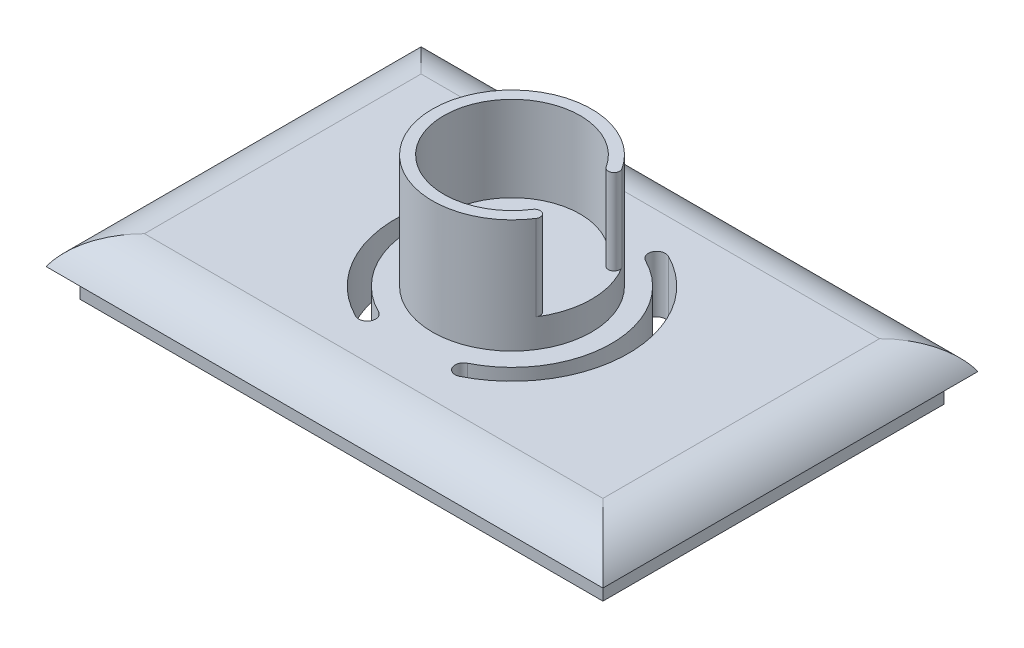
ISO-10303-21;
HEADER;
FILE_DESCRIPTION(('STEP AP214'),'2;1');
FILE_NAME('part.step','',(''),(''),'','','');
FILE_SCHEMA(('AUTOMOTIVE_DESIGN { 1 0 10303 214 1 1 1 1 }'));
ENDSEC;
DATA;
#1=APPLICATION_CONTEXT('core data for automotive mechanical design processes');
#2=APPLICATION_PROTOCOL_DEFINITION('international standard','automotive_design',2000,#1);
#3=PRODUCT_CONTEXT('',#1,'mechanical');
#4=PRODUCT('Part','Part','',(#3));
#5=PRODUCT_RELATED_PRODUCT_CATEGORY('part','',(#4));
#6=PRODUCT_DEFINITION_FORMATION('','',#4);
#7=PRODUCT_DEFINITION_CONTEXT('part definition',#1,'design');
#8=PRODUCT_DEFINITION('design','',#6,#7);
#9=PRODUCT_DEFINITION_SHAPE('','',#8);
#10=(LENGTH_UNIT() NAMED_UNIT(*) SI_UNIT(.MILLI.,.METRE.));
#11=(NAMED_UNIT(*) PLANE_ANGLE_UNIT() SI_UNIT($,.RADIAN.));
#12=(NAMED_UNIT(*) SI_UNIT($,.STERADIAN.) SOLID_ANGLE_UNIT());
#13=UNCERTAINTY_MEASURE_WITH_UNIT(LENGTH_MEASURE(1.E-05),#10,'distance_accuracy_value','');
#14=(GEOMETRIC_REPRESENTATION_CONTEXT(3) GLOBAL_UNCERTAINTY_ASSIGNED_CONTEXT((#13)) GLOBAL_UNIT_ASSIGNED_CONTEXT((#10,
#11,#12)) REPRESENTATION_CONTEXT('',''));
#15=CARTESIAN_POINT('',(0.,0.,0.));
#16=DIRECTION('',(0.,0.,1.));
#17=DIRECTION('',(1.,0.,0.));
#18=AXIS2_PLACEMENT_3D('',#15,#16,#17);
#19=CARTESIAN_POINT('',(45.9997459621556,15.,-29.9997459621556));
#20=DIRECTION('',(0.,1.,0.));
#21=DIRECTION('',(0.,0.,1.));
#22=AXIS2_PLACEMENT_3D('',#19,#20,#21);
#23=PLANE('',#22);
#24=CARTESIAN_POINT('',(45.9997459621556,15.,-29.9997459621556));
#25=DIRECTION('',(0.,1.,0.));
#26=DIRECTION('',(0.,0.,1.));
#27=AXIS2_PLACEMENT_3D('',#24,#25,#26);
#28=CIRCLE('',#27,2.75);
#29=CARTESIAN_POINT('',(45.9997459621556,15.,-27.2497459621556));
#30=VERTEX_POINT('',#29);
#31=EDGE_CURVE('E256',#30,#30,#28,.T.);
#32=ORIENTED_EDGE('',*,*,#31,.F.);
#33=EDGE_LOOP('',(#32));
#34=FACE_BOUND('',#33,.T.);
#35=CARTESIAN_POINT('',(56.9541971122589,15.,-22.9997459621556));
#36=DIRECTION('',(0.,1.,0.));
#37=DIRECTION('',(0.,0.,-1.));
#38=AXIS2_PLACEMENT_3D('',#35,#36,#37);
#39=CIRCLE('',#38,0.999999999999995);
#40=CARTESIAN_POINT('',(57.7968472007284,15.,-22.4612844236941));
#41=VERTEX_POINT('',#40);
#42=CARTESIAN_POINT('',(56.1115470237894,15.,-23.5382075006171));
#43=VERTEX_POINT('',#42);
#44=EDGE_CURVE('E238',#41,#43,#39,.T.);
#45=ORIENTED_EDGE('',*,*,#44,.F.);
#46=CARTESIAN_POINT('',(45.9997459621556,15.,-29.9997459621556));
#47=DIRECTION('',(0.,1.,0.));
#48=DIRECTION('',(0.,0.,1.));
#49=AXIS2_PLACEMENT_3D('',#46,#47,#48);
#50=CIRCLE('',#49,14.);
#51=CARTESIAN_POINT('',(57.7968472007284,15.,-37.5382075006171));
#52=VERTEX_POINT('',#51);
#53=EDGE_CURVE('E311',#41,#52,#50,.T.);
#54=ORIENTED_EDGE('',*,*,#53,.T.);
#55=CARTESIAN_POINT('',(56.9541971122589,15.,-36.9997459621556));
#56=DIRECTION('',(0.,1.,0.));
#57=DIRECTION('',(0.,0.,1.));
#58=AXIS2_PLACEMENT_3D('',#55,#56,#57);
#59=CIRCLE('',#58,0.999999999999995);
#60=CARTESIAN_POINT('',(56.1115470237894,15.,-36.4612844236941));
#61=VERTEX_POINT('',#60);
#62=EDGE_CURVE('E275',#61,#52,#59,.T.);
#63=ORIENTED_EDGE('',*,*,#62,.F.);
#64=CARTESIAN_POINT('',(45.9997459621556,15.,-29.9997459621556));
#65=DIRECTION('',(0.,-1.,0.));
#66=DIRECTION('',(0.,0.,1.));
#67=AXIS2_PLACEMENT_3D('',#64,#65,#66);
#68=CIRCLE('',#67,12.);
#69=EDGE_CURVE('E288',#43,#61,#68,.T.);
#70=ORIENTED_EDGE('',*,*,#69,.F.);
#71=EDGE_LOOP('',(#45,#54,#63,#70));
#72=FACE_BOUND('',#71,.T.);
#73=ADVANCED_FACE('F49',(#34,#72),#23,.T.);
#74=CARTESIAN_POINT('',(95.,0.,-54.3397459621556));
#75=DIRECTION('',(-1.,0.,0.));
#76=DIRECTION('',(0.,0.,1.));
#77=AXIS2_PLACEMENT_3D('',#74,#75,#76);
#78=CYLINDRICAL_SURFACE('',#77,10.);
#79=CARTESIAN_POINT('',(86.3397459621556,10.,-54.3397459621556));
#80=CARTESIAN_POINT('',(90.,10.,-58.));
#81=CARTESIAN_POINT('',(93.1698729810779,8.16987298107781,-61.1698729810779));
#82=CARTESIAN_POINT('',(95.,5.,-63.));
#83=(BOUNDED_CURVE() B_SPLINE_CURVE(3,(#79,#80,#81,#82),.UNSPECIFIED.,.F.,
.F.) B_SPLINE_CURVE_WITH_KNOTS((4,4),(4.71238898038469,5.75958653158129),
.UNSPECIFIED.) CURVE() GEOMETRIC_REPRESENTATION_ITEM() RATIONAL_B_SPLINE_CURVE((1.,
0.910683602522959,0.910683602522959,1.)) REPRESENTATION_ITEM(''));
#84=CARTESIAN_POINT('',(86.3397459621556,10.,-54.3397459621556));
#85=VERTEX_POINT('',#84);
#86=CARTESIAN_POINT('',(95.,5.,-63.));
#87=VERTEX_POINT('',#86);
#88=EDGE_CURVE('E347',#85,#87,#83,.T.);
#89=ORIENTED_EDGE('',*,*,#88,.T.);
#90=DIRECTION('',(-1.,0.,0.));
#91=VECTOR('',#90,1.);
#92=CARTESIAN_POINT('',(95.,5.,-63.));
#93=LINE('',#92,#91);
#94=CARTESIAN_POINT('',(-3.,5.,-63.));
#95=VERTEX_POINT('',#94);
#96=EDGE_CURVE('E377',#87,#95,#93,.T.);
#97=ORIENTED_EDGE('',*,*,#96,.T.);
#98=CARTESIAN_POINT('',(-3.,5.,-63.));
#99=CARTESIAN_POINT('',(-1.16987298107782,8.1698729810778,-61.1698729810777));
#100=CARTESIAN_POINT('',(1.99999999999999,10.,-58.));
#101=CARTESIAN_POINT('',(5.66025403784438,10.,-54.3397459621556));
#102=(BOUNDED_CURVE() B_SPLINE_CURVE(3,(#98,#99,#100,#101),.UNSPECIFIED.,.F.,
.F.) B_SPLINE_CURVE_WITH_KNOTS((4,4),(3.66519142918809,4.71238898038469),
.UNSPECIFIED.) CURVE() GEOMETRIC_REPRESENTATION_ITEM() RATIONAL_B_SPLINE_CURVE((1.,
0.910683602522959,0.910683602522959,1.)) REPRESENTATION_ITEM(''));
#103=CARTESIAN_POINT('',(5.66025403784438,10.,-54.3397459621556));
#104=VERTEX_POINT('',#103);
#105=EDGE_CURVE('E341',#95,#104,#102,.T.);
#106=ORIENTED_EDGE('',*,*,#105,.T.);
#107=DIRECTION('',(-1.,0.,0.));
#108=VECTOR('',#107,1.);
#109=CARTESIAN_POINT('',(-3.,10.,-54.3397459621556));
#110=LINE('',#109,#108);
#111=EDGE_CURVE('E393',#85,#104,#110,.T.);
#112=ORIENTED_EDGE('',*,*,#111,.F.);
#113=EDGE_LOOP('',(#89,#97,#106,#112));
#114=FACE_BOUND('',#113,.T.);
#115=ADVANCED_FACE('F482',(#114),#78,.T.);
#116=CARTESIAN_POINT('',(5.66025403784438,0.,-63.));
#117=DIRECTION('',(0.,0.,1.));
#118=DIRECTION('',(1.,0.,0.));
#119=AXIS2_PLACEMENT_3D('',#116,#117,#118);
#120=CYLINDRICAL_SURFACE('',#119,10.);
#121=CARTESIAN_POINT('',(-3.,5.,3.));
#122=CARTESIAN_POINT('',(-1.1698729810778,8.16987298107781,1.1698729810778));
#123=CARTESIAN_POINT('',(2.,10.,-2.));
#124=CARTESIAN_POINT('',(5.66025403784439,10.,-5.66025403784439));
#125=(BOUNDED_CURVE() B_SPLINE_CURVE(3,(#121,#122,#123,#124),.UNSPECIFIED.,.F.,
.F.) B_SPLINE_CURVE_WITH_KNOTS((4,4),(0.523598775598299,1.5707963267949),
.UNSPECIFIED.) CURVE() GEOMETRIC_REPRESENTATION_ITEM() RATIONAL_B_SPLINE_CURVE((1.,
0.910683602522959,0.910683602522959,1.)) REPRESENTATION_ITEM(''));
#126=CARTESIAN_POINT('',(-3.,5.,3.));
#127=VERTEX_POINT('',#126);
#128=CARTESIAN_POINT('',(5.66025403784439,10.,-5.66025403784439));
#129=VERTEX_POINT('',#128);
#130=EDGE_CURVE('E405',#127,#129,#125,.T.);
#131=ORIENTED_EDGE('',*,*,#130,.T.);
#132=DIRECTION('',(0.,0.,1.));
#133=VECTOR('',#132,1.);
#134=CARTESIAN_POINT('',(5.66025403784439,10.,3.));
#135=LINE('',#134,#133);
#136=EDGE_CURVE('E397',#104,#129,#135,.T.);
#137=ORIENTED_EDGE('',*,*,#136,.F.);
#138=ORIENTED_EDGE('',*,*,#105,.F.);
#139=DIRECTION('',(0.,0.,1.));
#140=VECTOR('',#139,1.);
#141=CARTESIAN_POINT('',(-3.,5.,-63.));
#142=LINE('',#141,#140);
#143=EDGE_CURVE('E367',#95,#127,#142,.T.);
#144=ORIENTED_EDGE('',*,*,#143,.T.);
#145=EDGE_LOOP('',(#131,#137,#138,#144));
#146=FACE_BOUND('',#145,.T.);
#147=ADVANCED_FACE('F51',(#146),#120,.T.);
#148=CARTESIAN_POINT('',(86.3397459621556,0.,3.));
#149=DIRECTION('',(0.,0.,-1.));
#150=DIRECTION('',(-1.,0.,0.));
#151=AXIS2_PLACEMENT_3D('',#148,#149,#150);
#152=CYLINDRICAL_SURFACE('',#151,10.);
#153=CARTESIAN_POINT('',(86.3397459621556,10.,-5.66025403784439));
#154=CARTESIAN_POINT('',(90.,10.,-2.));
#155=CARTESIAN_POINT('',(93.1698729810779,8.16987298107781,1.1698729810778));
#156=CARTESIAN_POINT('',(95.,5.,3.));
#157=(BOUNDED_CURVE() B_SPLINE_CURVE(3,(#153,#154,#155,#156),.UNSPECIFIED.,.F.,
.F.) B_SPLINE_CURVE_WITH_KNOTS((4,4),(4.71238898038469,5.75958653158129),
.UNSPECIFIED.) CURVE() GEOMETRIC_REPRESENTATION_ITEM() RATIONAL_B_SPLINE_CURVE((1.,
0.910683602522959,0.910683602522959,1.)) REPRESENTATION_ITEM(''));
#158=CARTESIAN_POINT('',(86.3397459621556,10.,-5.66025403784439));
#159=VERTEX_POINT('',#158);
#160=CARTESIAN_POINT('',(95.,5.,3.));
#161=VERTEX_POINT('',#160);
#162=EDGE_CURVE('E410',#159,#161,#157,.T.);
#163=ORIENTED_EDGE('',*,*,#162,.T.);
#164=DIRECTION('',(0.,0.,-1.));
#165=VECTOR('',#164,1.);
#166=CARTESIAN_POINT('',(95.,5.,3.));
#167=LINE('',#166,#165);
#168=EDGE_CURVE('E381',#161,#87,#167,.T.);
#169=ORIENTED_EDGE('',*,*,#168,.T.);
#170=ORIENTED_EDGE('',*,*,#88,.F.);
#171=DIRECTION('',(0.,0.,-1.));
#172=VECTOR('',#171,1.);
#173=CARTESIAN_POINT('',(86.3397459621556,10.,-63.));
#174=LINE('',#173,#172);
#175=EDGE_CURVE('E389',#159,#85,#174,.T.);
#176=ORIENTED_EDGE('',*,*,#175,.F.);
#177=EDGE_LOOP('',(#163,#169,#170,#176));
#178=FACE_BOUND('',#177,.T.);
#179=ADVANCED_FACE('F511',(#178),#152,.T.);
#180=CARTESIAN_POINT('',(-3.,0.,-5.66025403784439));
#181=DIRECTION('',(1.,0.,0.));
#182=DIRECTION('',(0.,0.,-1.));
#183=AXIS2_PLACEMENT_3D('',#180,#181,#182);
#184=CYLINDRICAL_SURFACE('',#183,10.);
#185=ORIENTED_EDGE('',*,*,#130,.F.);
#186=DIRECTION('',(1.,0.,0.));
#187=VECTOR('',#186,1.);
#188=CARTESIAN_POINT('',(-3.,5.,3.));
#189=LINE('',#188,#187);
#190=EDGE_CURVE('E385',#127,#161,#189,.T.);
#191=ORIENTED_EDGE('',*,*,#190,.T.);
#192=ORIENTED_EDGE('',*,*,#162,.F.);
#193=DIRECTION('',(1.,0.,0.));
#194=VECTOR('',#193,1.);
#195=CARTESIAN_POINT('',(95.,10.,-5.66025403784439));
#196=LINE('',#195,#194);
#197=EDGE_CURVE('E401',#129,#159,#196,.T.);
#198=ORIENTED_EDGE('',*,*,#197,.F.);
#199=EDGE_LOOP('',(#185,#191,#192,#198));
#200=FACE_BOUND('',#199,.T.);
#201=ADVANCED_FACE('F509',(#200),#184,.T.);
#202=CARTESIAN_POINT('',(0.,10.,0.));
#203=DIRECTION('',(0.,1.,0.));
#204=DIRECTION('',(1.,0.,0.));
#205=AXIS2_PLACEMENT_3D('',#202,#203,#204);
#206=PLANE('',#205);
#207=CARTESIAN_POINT('',(45.9997459621556,10.,-29.9997459621556));
#208=DIRECTION('',(0.,1.,0.));
#209=DIRECTION('',(0.,0.,1.));
#210=AXIS2_PLACEMENT_3D('',#207,#208,#209);
#211=CIRCLE('',#210,20.5);
#212=CARTESIAN_POINT('',(55.1549179712025,10.,-11.6576406989977));
#213=VERTEX_POINT('',#212);
#214=CARTESIAN_POINT('',(55.1549179712025,10.,-48.3418512253135));
#215=VERTEX_POINT('',#214);
#216=EDGE_CURVE('E65',#213,#215,#211,.T.);
#217=ORIENTED_EDGE('',*,*,#216,.F.);
#218=CARTESIAN_POINT('',(54.4850273363942,10.,-12.9997459621556));
#219=DIRECTION('',(0.,1.,0.));
#220=DIRECTION('',(0.,0.,-1.));
#221=AXIS2_PLACEMENT_3D('',#218,#219,#220);
#222=CIRCLE('',#221,1.5);
#223=CARTESIAN_POINT('',(53.8151367015859,10.,-14.3418512253135));
#224=VERTEX_POINT('',#223);
#225=EDGE_CURVE('E228',#224,#213,#222,.T.);
#226=ORIENTED_EDGE('',*,*,#225,.F.);
#227=CARTESIAN_POINT('',(45.9997459621556,10.,-29.9997459621556));
#228=DIRECTION('',(0.,-1.,0.));
#229=DIRECTION('',(0.,0.,1.));
#230=AXIS2_PLACEMENT_3D('',#227,#228,#229);
#231=CIRCLE('',#230,17.5);
#232=CARTESIAN_POINT('',(53.8151367015859,10.,-45.6576406989977));
#233=VERTEX_POINT('',#232);
#234=EDGE_CURVE('E209',#233,#224,#231,.T.);
#235=ORIENTED_EDGE('',*,*,#234,.F.);
#236=CARTESIAN_POINT('',(54.4850273363942,10.,-46.9997459621556));
#237=DIRECTION('',(0.,1.,0.));
#238=DIRECTION('',(0.,0.,1.));
#239=AXIS2_PLACEMENT_3D('',#236,#237,#238);
#240=CIRCLE('',#239,1.50000000000001);
#241=EDGE_CURVE('E220',#215,#233,#240,.T.);
#242=ORIENTED_EDGE('',*,*,#241,.F.);
#243=EDGE_LOOP('',(#217,#226,#235,#242));
#244=FACE_BOUND('',#243,.T.);
#245=CARTESIAN_POINT('',(37.514464587917,10.,-46.9997459621556));
#246=DIRECTION('',(0.,1.,0.));
#247=DIRECTION('',(0.,0.,-1.));
#248=AXIS2_PLACEMENT_3D('',#245,#246,#247);
#249=CIRCLE('',#248,1.50000000000001);
#250=CARTESIAN_POINT('',(38.1843552227253,10.,-45.6576406989977));
#251=VERTEX_POINT('',#250);
#252=CARTESIAN_POINT('',(36.8445739531087,10.,-48.3418512253135));
#253=VERTEX_POINT('',#252);
#254=EDGE_CURVE('E73',#251,#253,#249,.T.);
#255=ORIENTED_EDGE('',*,*,#254,.F.);
#256=CARTESIAN_POINT('',(45.9997459621556,10.,-29.9997459621556));
#257=DIRECTION('',(0.,-1.,0.));
#258=DIRECTION('',(0.,0.,1.));
#259=AXIS2_PLACEMENT_3D('',#256,#257,#258);
#260=CIRCLE('',#259,17.5);
#261=CARTESIAN_POINT('',(38.1843552227253,10.,-14.3418512253135));
#262=VERTEX_POINT('',#261);
#263=EDGE_CURVE('E246',#262,#251,#260,.T.);
#264=ORIENTED_EDGE('',*,*,#263,.F.);
#265=CARTESIAN_POINT('',(37.514464587917,10.,-12.9997459621556));
#266=DIRECTION('',(0.,1.,0.));
#267=DIRECTION('',(0.,0.,1.));
#268=AXIS2_PLACEMENT_3D('',#265,#266,#267);
#269=CIRCLE('',#268,1.5);
#270=CARTESIAN_POINT('',(36.8445739531087,10.,-11.6576406989977));
#271=VERTEX_POINT('',#270);
#272=EDGE_CURVE('E260',#271,#262,#269,.T.);
#273=ORIENTED_EDGE('',*,*,#272,.F.);
#274=CARTESIAN_POINT('',(45.9997459621556,10.,-29.9997459621556));
#275=DIRECTION('',(0.,1.,0.));
#276=DIRECTION('',(0.,0.,1.));
#277=AXIS2_PLACEMENT_3D('',#274,#275,#276);
#278=CIRCLE('',#277,20.5);
#279=EDGE_CURVE('E264',#253,#271,#278,.T.);
#280=ORIENTED_EDGE('',*,*,#279,.F.);
#281=EDGE_LOOP('',(#255,#264,#273,#280));
#282=FACE_BOUND('',#281,.T.);
#283=CARTESIAN_POINT('',(45.9997459621556,10.,-29.9997459621556));
#284=DIRECTION('',(0.,1.,0.));
#285=DIRECTION('',(0.,0.,1.));
#286=AXIS2_PLACEMENT_3D('',#283,#284,#285);
#287=CIRCLE('',#286,14.);
#288=CARTESIAN_POINT('',(45.9997459621556,10.,-15.9997459621556));
#289=VERTEX_POINT('',#288);
#290=EDGE_CURVE('E310',#289,#289,#287,.T.);
#291=ORIENTED_EDGE('',*,*,#290,.F.);
#292=EDGE_LOOP('',(#291));
#293=FACE_BOUND('',#292,.T.);
#294=ORIENTED_EDGE('',*,*,#175,.T.);
#295=ORIENTED_EDGE('',*,*,#111,.T.);
#296=ORIENTED_EDGE('',*,*,#136,.T.);
#297=ORIENTED_EDGE('',*,*,#197,.T.);
#298=EDGE_LOOP('',(#294,#295,#296,#297));
#299=FACE_BOUND('',#298,.T.);
#300=ADVANCED_FACE('F225',(#244,#282,#293,#299),#206,.T.);
#301=CARTESIAN_POINT('',(0.,5.,0.));
#302=DIRECTION('',(0.,1.,0.));
#303=DIRECTION('',(1.,0.,0.));
#304=AXIS2_PLACEMENT_3D('',#301,#302,#303);
#305=PLANE('',#304);
#306=DIRECTION('',(-1.,0.,0.));
#307=VECTOR('',#306,1.);
#308=CARTESIAN_POINT('',(0.,5.,-60.));
#309=LINE('',#308,#307);
#310=CARTESIAN_POINT('',(92.,5.,-60.));
#311=VERTEX_POINT('',#310);
#312=CARTESIAN_POINT('',(0.,5.,-60.));
#313=VERTEX_POINT('',#312);
#314=EDGE_CURVE('E364',#311,#313,#309,.T.);
#315=ORIENTED_EDGE('',*,*,#314,.T.);
#316=DIRECTION('',(0.,0.,1.));
#317=VECTOR('',#316,1.);
#318=CARTESIAN_POINT('',(0.,5.,0.));
#319=LINE('',#318,#317);
#320=CARTESIAN_POINT('',(0.,5.,0.));
#321=VERTEX_POINT('',#320);
#322=EDGE_CURVE('E337',#313,#321,#319,.T.);
#323=ORIENTED_EDGE('',*,*,#322,.T.);
#324=DIRECTION('',(1.,0.,0.));
#325=VECTOR('',#324,1.);
#326=CARTESIAN_POINT('',(0.,5.,0.));
#327=LINE('',#326,#325);
#328=CARTESIAN_POINT('',(92.,5.,0.));
#329=VERTEX_POINT('',#328);
#330=EDGE_CURVE('E348',#321,#329,#327,.T.);
#331=ORIENTED_EDGE('',*,*,#330,.T.);
#332=DIRECTION('',(0.,0.,-1.));
#333=VECTOR('',#332,1.);
#334=CARTESIAN_POINT('',(92.,5.,0.));
#335=LINE('',#334,#333);
#336=EDGE_CURVE('E332',#329,#311,#335,.T.);
#337=ORIENTED_EDGE('',*,*,#336,.T.);
#338=EDGE_LOOP('',(#315,#323,#331,#337));
#339=FACE_BOUND('',#338,.T.);
#340=ORIENTED_EDGE('',*,*,#143,.F.);
#341=ORIENTED_EDGE('',*,*,#96,.F.);
#342=ORIENTED_EDGE('',*,*,#168,.F.);
#343=ORIENTED_EDGE('',*,*,#190,.F.);
#344=EDGE_LOOP('',(#340,#341,#342,#343));
#345=FACE_BOUND('',#344,.T.);
#346=ADVANCED_FACE('F468',(#339,#345),#305,.F.);
#347=CARTESIAN_POINT('',(0.,0.,0.));
#348=DIRECTION('',(0.,-1.,0.));
#349=DIRECTION('',(0.,0.,-1.));
#350=AXIS2_PLACEMENT_3D('',#347,#348,#349);
#351=PLANE('',#350);
#352=CARTESIAN_POINT('',(45.9997459621556,0.,-29.9997459621556));
#353=DIRECTION('',(0.,-1.,0.));
#354=DIRECTION('',(0.,0.,-1.));
#355=AXIS2_PLACEMENT_3D('',#352,#353,#354);
#356=CIRCLE('',#355,2.75);
#357=CARTESIAN_POINT('',(45.9997459621556,0.,-32.7497459621556));
#358=VERTEX_POINT('',#357);
#359=EDGE_CURVE('E459',#358,#358,#356,.T.);
#360=ORIENTED_EDGE('',*,*,#359,.F.);
#361=EDGE_LOOP('',(#360));
#362=FACE_BOUND('',#361,.T.);
#363=CARTESIAN_POINT('',(45.9997459621556,0.,-29.9997459621556));
#364=DIRECTION('',(0.,-1.,0.));
#365=DIRECTION('',(0.,0.,-1.));
#366=AXIS2_PLACEMENT_3D('',#363,#364,#365);
#367=CIRCLE('',#366,20.5);
#368=CARTESIAN_POINT('',(55.1549179712025,0.,-48.3418512253135));
#369=VERTEX_POINT('',#368);
#370=CARTESIAN_POINT('',(55.1549179712025,0.,-11.6576406989977));
#371=VERTEX_POINT('',#370);
#372=EDGE_CURVE('E11',#369,#371,#367,.T.);
#373=ORIENTED_EDGE('',*,*,#372,.F.);
#374=CARTESIAN_POINT('',(54.4850273363942,0.,-46.9997459621556));
#375=DIRECTION('',(0.,-1.,0.));
#376=DIRECTION('',(0.,0.,-1.));
#377=AXIS2_PLACEMENT_3D('',#374,#375,#376);
#378=CIRCLE('',#377,1.50000000000001);
#379=CARTESIAN_POINT('',(53.8151367015859,0.,-45.6576406989977));
#380=VERTEX_POINT('',#379);
#381=EDGE_CURVE('E440',#380,#369,#378,.T.);
#382=ORIENTED_EDGE('',*,*,#381,.F.);
#383=CARTESIAN_POINT('',(45.9997459621556,0.,-29.9997459621556));
#384=DIRECTION('',(0.,-1.,0.));
#385=DIRECTION('',(0.,0.,-1.));
#386=AXIS2_PLACEMENT_3D('',#383,#384,#385);
#387=CIRCLE('',#386,17.5);
#388=CARTESIAN_POINT('',(53.8151367015859,0.,-14.3418512253135));
#389=VERTEX_POINT('',#388);
#390=EDGE_CURVE('E212',#389,#380,#387,.F.);
#391=ORIENTED_EDGE('',*,*,#390,.F.);
#392=CARTESIAN_POINT('',(54.4850273363942,0.,-12.9997459621556));
#393=DIRECTION('',(0.,-1.,0.));
#394=DIRECTION('',(0.,0.,-1.));
#395=AXIS2_PLACEMENT_3D('',#392,#393,#394);
#396=CIRCLE('',#395,1.5);
#397=EDGE_CURVE('E58',#371,#389,#396,.T.);
#398=ORIENTED_EDGE('',*,*,#397,.F.);
#399=EDGE_LOOP('',(#373,#382,#391,#398));
#400=FACE_BOUND('',#399,.T.);
#401=CARTESIAN_POINT('',(37.514464587917,0.,-46.9997459621556));
#402=DIRECTION('',(0.,-1.,0.));
#403=DIRECTION('',(0.,0.,-1.));
#404=AXIS2_PLACEMENT_3D('',#401,#402,#403);
#405=CIRCLE('',#404,1.50000000000001);
#406=CARTESIAN_POINT('',(36.8445739531087,0.,-48.3418512253135));
#407=VERTEX_POINT('',#406);
#408=CARTESIAN_POINT('',(38.1843552227253,0.,-45.6576406989977));
#409=VERTEX_POINT('',#408);
#410=EDGE_CURVE('E437',#407,#409,#405,.T.);
#411=ORIENTED_EDGE('',*,*,#410,.F.);
#412=CARTESIAN_POINT('',(45.9997459621556,0.,-29.9997459621556));
#413=DIRECTION('',(0.,-1.,0.));
#414=DIRECTION('',(0.,0.,-1.));
#415=AXIS2_PLACEMENT_3D('',#412,#413,#414);
#416=CIRCLE('',#415,20.5);
#417=CARTESIAN_POINT('',(36.8445739531087,0.,-11.6576406989977));
#418=VERTEX_POINT('',#417);
#419=EDGE_CURVE('E346',#418,#407,#416,.T.);
#420=ORIENTED_EDGE('',*,*,#419,.F.);
#421=CARTESIAN_POINT('',(37.514464587917,0.,-12.9997459621556));
#422=DIRECTION('',(0.,-1.,0.));
#423=DIRECTION('',(0.,0.,-1.));
#424=AXIS2_PLACEMENT_3D('',#421,#422,#423);
#425=CIRCLE('',#424,1.5);
#426=CARTESIAN_POINT('',(38.1843552227253,0.,-14.3418512253135));
#427=VERTEX_POINT('',#426);
#428=EDGE_CURVE('E430',#427,#418,#425,.T.);
#429=ORIENTED_EDGE('',*,*,#428,.F.);
#430=CARTESIAN_POINT('',(45.9997459621556,0.,-29.9997459621556));
#431=DIRECTION('',(0.,-1.,0.));
#432=DIRECTION('',(0.,0.,-1.));
#433=AXIS2_PLACEMENT_3D('',#430,#431,#432);
#434=CIRCLE('',#433,17.5);
#435=EDGE_CURVE('E434',#409,#427,#434,.F.);
#436=ORIENTED_EDGE('',*,*,#435,.F.);
#437=EDGE_LOOP('',(#411,#420,#429,#436));
#438=FACE_BOUND('',#437,.T.);
#439=DIRECTION('',(0.,0.,1.));
#440=VECTOR('',#439,1.);
#441=CARTESIAN_POINT('',(0.,0.,0.));
#442=LINE('',#441,#440);
#443=CARTESIAN_POINT('',(0.,0.,-60.));
#444=VERTEX_POINT('',#443);
#445=CARTESIAN_POINT('',(0.,0.,0.));
#446=VERTEX_POINT('',#445);
#447=EDGE_CURVE('E314',#444,#446,#442,.T.);
#448=ORIENTED_EDGE('',*,*,#447,.F.);
#449=DIRECTION('',(-1.,0.,0.));
#450=VECTOR('',#449,1.);
#451=CARTESIAN_POINT('',(0.,0.,-60.));
#452=LINE('',#451,#450);
#453=CARTESIAN_POINT('',(92.,0.,-60.));
#454=VERTEX_POINT('',#453);
#455=EDGE_CURVE('E368',#454,#444,#452,.T.);
#456=ORIENTED_EDGE('',*,*,#455,.F.);
#457=DIRECTION('',(0.,0.,-1.));
#458=VECTOR('',#457,1.);
#459=CARTESIAN_POINT('',(92.,0.,0.));
#460=LINE('',#459,#458);
#461=CARTESIAN_POINT('',(92.,0.,0.));
#462=VERTEX_POINT('',#461);
#463=EDGE_CURVE('E333',#462,#454,#460,.T.);
#464=ORIENTED_EDGE('',*,*,#463,.F.);
#465=DIRECTION('',(1.,0.,0.));
#466=VECTOR('',#465,1.);
#467=CARTESIAN_POINT('',(0.,0.,0.));
#468=LINE('',#467,#466);
#469=EDGE_CURVE('E318',#446,#462,#468,.T.);
#470=ORIENTED_EDGE('',*,*,#469,.F.);
#471=EDGE_LOOP('',(#448,#456,#464,#470));
#472=FACE_BOUND('',#471,.T.);
#473=ADVANCED_FACE('F451',(#362,#400,#438,#472),#351,.T.);
#474=CARTESIAN_POINT('',(0.,5.,-60.));
#475=DIRECTION('',(0.,0.,1.));
#476=DIRECTION('',(1.,0.,0.));
#477=AXIS2_PLACEMENT_3D('',#474,#475,#476);
#478=PLANE('',#477);
#479=ORIENTED_EDGE('',*,*,#455,.T.);
#480=DIRECTION('',(0.,-1.,0.));
#481=VECTOR('',#480,1.);
#482=CARTESIAN_POINT('',(0.,5.,-60.));
#483=LINE('',#482,#481);
#484=EDGE_CURVE('E323',#313,#444,#483,.T.);
#485=ORIENTED_EDGE('',*,*,#484,.F.);
#486=ORIENTED_EDGE('',*,*,#314,.F.);
#487=DIRECTION('',(0.,-1.,0.));
#488=VECTOR('',#487,1.);
#489=CARTESIAN_POINT('',(92.,5.,-60.));
#490=LINE('',#489,#488);
#491=EDGE_CURVE('E328',#311,#454,#490,.T.);
#492=ORIENTED_EDGE('',*,*,#491,.T.);
#493=EDGE_LOOP('',(#479,#485,#486,#492));
#494=FACE_BOUND('',#493,.T.);
#495=ADVANCED_FACE('F467',(#494),#478,.F.);
#496=CARTESIAN_POINT('',(92.,5.,0.));
#497=DIRECTION('',(-1.,0.,0.));
#498=DIRECTION('',(0.,1.,0.));
#499=AXIS2_PLACEMENT_3D('',#496,#497,#498);
#500=PLANE('',#499);
#501=ORIENTED_EDGE('',*,*,#463,.T.);
#502=ORIENTED_EDGE('',*,*,#491,.F.);
#503=ORIENTED_EDGE('',*,*,#336,.F.);
#504=DIRECTION('',(0.,-1.,0.));
#505=VECTOR('',#504,1.);
#506=CARTESIAN_POINT('',(92.,5.,0.));
#507=LINE('',#506,#505);
#508=EDGE_CURVE('E322',#329,#462,#507,.T.);
#509=ORIENTED_EDGE('',*,*,#508,.T.);
#510=EDGE_LOOP('',(#501,#502,#503,#509));
#511=FACE_BOUND('',#510,.T.);
#512=ADVANCED_FACE('F474',(#511),#500,.F.);
#513=CARTESIAN_POINT('',(0.,5.,0.));
#514=DIRECTION('',(0.,0.,-1.));
#515=DIRECTION('',(0.,-1.,0.));
#516=AXIS2_PLACEMENT_3D('',#513,#514,#515);
#517=PLANE('',#516);
#518=ORIENTED_EDGE('',*,*,#469,.T.);
#519=ORIENTED_EDGE('',*,*,#508,.F.);
#520=ORIENTED_EDGE('',*,*,#330,.F.);
#521=DIRECTION('',(0.,-1.,0.));
#522=VECTOR('',#521,1.);
#523=CARTESIAN_POINT('',(0.,5.,0.));
#524=LINE('',#523,#522);
#525=EDGE_CURVE('E327',#321,#446,#524,.T.);
#526=ORIENTED_EDGE('',*,*,#525,.T.);
#527=EDGE_LOOP('',(#518,#519,#520,#526));
#528=FACE_BOUND('',#527,.T.);
#529=ADVANCED_FACE('F502',(#528),#517,.F.);
#530=CARTESIAN_POINT('',(0.,5.,0.));
#531=DIRECTION('',(1.,0.,0.));
#532=DIRECTION('',(0.,0.,-1.));
#533=AXIS2_PLACEMENT_3D('',#530,#531,#532);
#534=PLANE('',#533);
#535=ORIENTED_EDGE('',*,*,#447,.T.);
#536=ORIENTED_EDGE('',*,*,#525,.F.);
#537=ORIENTED_EDGE('',*,*,#322,.F.);
#538=ORIENTED_EDGE('',*,*,#484,.T.);
#539=EDGE_LOOP('',(#535,#536,#537,#538));
#540=FACE_BOUND('',#539,.T.);
#541=ADVANCED_FACE('F498',(#540),#534,.F.);
#542=CARTESIAN_POINT('',(45.9997459621556,15.,-29.9997459621556));
#543=DIRECTION('',(0.,-1.,0.));
#544=DIRECTION('',(0.,0.,-1.));
#545=AXIS2_PLACEMENT_3D('',#542,#543,#544);
#546=CYLINDRICAL_SURFACE('',#545,14.);
#547=ORIENTED_EDGE('',*,*,#53,.F.);
#548=DIRECTION('',(0.,-1.,0.));
#549=VECTOR('',#548,1.);
#550=CARTESIAN_POINT('',(57.7968472007284,30.,-22.4612844236941));
#551=LINE('',#550,#549);
#552=CARTESIAN_POINT('',(57.7968472007284,30.,-22.4612844236941));
#553=VERTEX_POINT('',#552);
#554=EDGE_CURVE('E284',#553,#41,#551,.T.);
#555=ORIENTED_EDGE('',*,*,#554,.F.);
#556=CARTESIAN_POINT('',(45.9997459621556,30.,-29.9997459621556));
#557=DIRECTION('',(0.,1.,0.));
#558=DIRECTION('',(0.,0.,1.));
#559=AXIS2_PLACEMENT_3D('',#556,#557,#558);
#560=CIRCLE('',#559,14.);
#561=CARTESIAN_POINT('',(57.7968472007284,30.,-37.5382075006171));
#562=VERTEX_POINT('',#561);
#563=EDGE_CURVE('E281',#562,#553,#560,.T.);
#564=ORIENTED_EDGE('',*,*,#563,.F.);
#565=DIRECTION('',(0.,-1.,0.));
#566=VECTOR('',#565,1.);
#567=CARTESIAN_POINT('',(57.7968472007284,30.,-37.5382075006171));
#568=LINE('',#567,#566);
#569=EDGE_CURVE('E298',#562,#52,#568,.T.);
#570=ORIENTED_EDGE('',*,*,#569,.T.);
#571=EDGE_LOOP('',(#547,#555,#564,#570));
#572=FACE_BOUND('',#571,.T.);
#573=ORIENTED_EDGE('',*,*,#290,.T.);
#574=EDGE_LOOP('',(#573));
#575=FACE_BOUND('',#574,.T.);
#576=ADVANCED_FACE('F495',(#572,#575),#546,.T.);
#577=CARTESIAN_POINT('',(56.9541971122589,30.,-22.9997459621556));
#578=DIRECTION('',(0.,-1.,0.));
#579=DIRECTION('',(0.,0.,-1.));
#580=AXIS2_PLACEMENT_3D('',#577,#578,#579);
#581=CYLINDRICAL_SURFACE('',#580,0.999999999999995);
#582=ORIENTED_EDGE('',*,*,#44,.T.);
#583=DIRECTION('',(0.,-1.,0.));
#584=VECTOR('',#583,1.);
#585=CARTESIAN_POINT('',(56.1115470237894,30.,-23.5382075006171));
#586=LINE('',#585,#584);
#587=CARTESIAN_POINT('',(56.1115470237894,30.,-23.5382075006171));
#588=VERTEX_POINT('',#587);
#589=EDGE_CURVE('E306',#588,#43,#586,.T.);
#590=ORIENTED_EDGE('',*,*,#589,.F.);
#591=CARTESIAN_POINT('',(56.9541971122589,30.,-22.9997459621556));
#592=DIRECTION('',(0.,1.,0.));
#593=DIRECTION('',(0.,0.,-1.));
#594=AXIS2_PLACEMENT_3D('',#591,#592,#593);
#595=CIRCLE('',#594,0.999999999999995);
#596=EDGE_CURVE('E270',#553,#588,#595,.T.);
#597=ORIENTED_EDGE('',*,*,#596,.F.);
#598=ORIENTED_EDGE('',*,*,#554,.T.);
#599=EDGE_LOOP('',(#582,#590,#597,#598));
#600=FACE_BOUND('',#599,.T.);
#601=ADVANCED_FACE('F493',(#600),#581,.T.);
#602=CARTESIAN_POINT('',(45.9997459621556,30.,-29.9997459621556));
#603=DIRECTION('',(0.,-1.,0.));
#604=DIRECTION('',(0.,0.,-1.));
#605=AXIS2_PLACEMENT_3D('',#602,#603,#604);
#606=CYLINDRICAL_SURFACE('',#605,12.);
#607=ORIENTED_EDGE('',*,*,#69,.T.);
#608=DIRECTION('',(0.,-1.,0.));
#609=VECTOR('',#608,1.);
#610=CARTESIAN_POINT('',(56.1115470237894,30.,-36.4612844236941));
#611=LINE('',#610,#609);
#612=CARTESIAN_POINT('',(56.1115470237894,30.,-36.4612844236941));
#613=VERTEX_POINT('',#612);
#614=EDGE_CURVE('E302',#613,#61,#611,.T.);
#615=ORIENTED_EDGE('',*,*,#614,.F.);
#616=CARTESIAN_POINT('',(45.9997459621556,30.,-29.9997459621556));
#617=DIRECTION('',(0.,-1.,0.));
#618=DIRECTION('',(0.,0.,1.));
#619=AXIS2_PLACEMENT_3D('',#616,#617,#618);
#620=CIRCLE('',#619,12.);
#621=EDGE_CURVE('E274',#588,#613,#620,.T.);
#622=ORIENTED_EDGE('',*,*,#621,.F.);
#623=ORIENTED_EDGE('',*,*,#589,.T.);
#624=EDGE_LOOP('',(#607,#615,#622,#623));
#625=FACE_BOUND('',#624,.T.);
#626=ADVANCED_FACE('F619',(#625),#606,.F.);
#627=CARTESIAN_POINT('',(56.9541971122589,30.,-36.9997459621556));
#628=DIRECTION('',(0.,-1.,0.));
#629=DIRECTION('',(0.,0.,-1.));
#630=AXIS2_PLACEMENT_3D('',#627,#628,#629);
#631=CYLINDRICAL_SURFACE('',#630,0.999999999999995);
#632=ORIENTED_EDGE('',*,*,#62,.T.);
#633=ORIENTED_EDGE('',*,*,#569,.F.);
#634=CARTESIAN_POINT('',(56.9541971122589,30.,-36.9997459621556));
#635=DIRECTION('',(0.,1.,0.));
#636=DIRECTION('',(0.,0.,1.));
#637=AXIS2_PLACEMENT_3D('',#634,#635,#636);
#638=CIRCLE('',#637,0.999999999999995);
#639=EDGE_CURVE('E278',#613,#562,#638,.T.);
#640=ORIENTED_EDGE('',*,*,#639,.F.);
#641=ORIENTED_EDGE('',*,*,#614,.T.);
#642=EDGE_LOOP('',(#632,#633,#640,#641));
#643=FACE_BOUND('',#642,.T.);
#644=ADVANCED_FACE('F629',(#643),#631,.T.);
#645=CARTESIAN_POINT('',(51.4769715372073,30.,-26.4997459621556));
#646=DIRECTION('',(0.,-1.,0.));
#647=DIRECTION('',(0.,0.,-1.));
#648=AXIS2_PLACEMENT_3D('',#645,#646,#647);
#649=PLANE('',#648);
#650=ORIENTED_EDGE('',*,*,#596,.T.);
#651=ORIENTED_EDGE('',*,*,#621,.T.);
#652=ORIENTED_EDGE('',*,*,#639,.T.);
#653=ORIENTED_EDGE('',*,*,#563,.T.);
#654=EDGE_LOOP('',(#650,#651,#652,#653));
#655=FACE_BOUND('',#654,.T.);
#656=ADVANCED_FACE('F639',(#655),#649,.F.);
#657=CARTESIAN_POINT('',(37.514464587917,-5.,-46.9997459621556));
#658=DIRECTION('',(0.,1.,0.));
#659=DIRECTION('',(0.,0.,1.));
#660=AXIS2_PLACEMENT_3D('',#657,#658,#659);
#661=CYLINDRICAL_SURFACE('',#660,1.50000000000001);
#662=ORIENTED_EDGE('',*,*,#410,.T.);
#663=DIRECTION('',(0.,1.,0.));
#664=VECTOR('',#663,1.);
#665=CARTESIAN_POINT('',(38.1843552227253,-5.,-45.6576406989977));
#666=LINE('',#665,#664);
#667=EDGE_CURVE('E253',#409,#251,#666,.T.);
#668=ORIENTED_EDGE('',*,*,#667,.T.);
#669=ORIENTED_EDGE('',*,*,#254,.T.);
#670=DIRECTION('',(0.,1.,0.));
#671=VECTOR('',#670,1.);
#672=CARTESIAN_POINT('',(36.8445739531087,-5.,-48.3418512253135));
#673=LINE('',#672,#671);
#674=EDGE_CURVE('E243',#407,#253,#673,.T.);
#675=ORIENTED_EDGE('',*,*,#674,.F.);
#676=EDGE_LOOP('',(#662,#668,#669,#675));
#677=FACE_BOUND('',#676,.T.);
#678=ADVANCED_FACE('F649',(#677),#661,.F.);
#679=CARTESIAN_POINT('',(45.9997459621556,-5.,-29.9997459621556));
#680=DIRECTION('',(0.,1.,0.));
#681=DIRECTION('',(0.,0.,1.));
#682=AXIS2_PLACEMENT_3D('',#679,#680,#681);
#683=CYLINDRICAL_SURFACE('',#682,17.5);
#684=ORIENTED_EDGE('',*,*,#435,.T.);
#685=DIRECTION('',(0.,1.,0.));
#686=VECTOR('',#685,1.);
#687=CARTESIAN_POINT('',(38.1843552227253,-5.,-14.3418512253135));
#688=LINE('',#687,#686);
#689=EDGE_CURVE('E250',#427,#262,#688,.T.);
#690=ORIENTED_EDGE('',*,*,#689,.T.);
#691=ORIENTED_EDGE('',*,*,#263,.T.);
#692=ORIENTED_EDGE('',*,*,#667,.F.);
#693=EDGE_LOOP('',(#684,#690,#691,#692));
#694=FACE_BOUND('',#693,.T.);
#695=ADVANCED_FACE('F663',(#694),#683,.T.);
#696=CARTESIAN_POINT('',(37.514464587917,-5.,-12.9997459621556));
#697=DIRECTION('',(0.,1.,0.));
#698=DIRECTION('',(0.,0.,1.));
#699=AXIS2_PLACEMENT_3D('',#696,#697,#698);
#700=CYLINDRICAL_SURFACE('',#699,1.5);
#701=ORIENTED_EDGE('',*,*,#428,.T.);
#702=DIRECTION('',(0.,1.,0.));
#703=VECTOR('',#702,1.);
#704=CARTESIAN_POINT('',(36.8445739531087,-5.,-11.6576406989977));
#705=LINE('',#704,#703);
#706=EDGE_CURVE('E247',#418,#271,#705,.T.);
#707=ORIENTED_EDGE('',*,*,#706,.T.);
#708=ORIENTED_EDGE('',*,*,#272,.T.);
#709=ORIENTED_EDGE('',*,*,#689,.F.);
#710=EDGE_LOOP('',(#701,#707,#708,#709));
#711=FACE_BOUND('',#710,.T.);
#712=ADVANCED_FACE('F673',(#711),#700,.F.);
#713=CARTESIAN_POINT('',(45.9997459621556,-5.,-29.9997459621556));
#714=DIRECTION('',(0.,1.,0.));
#715=DIRECTION('',(0.,0.,1.));
#716=AXIS2_PLACEMENT_3D('',#713,#714,#715);
#717=CYLINDRICAL_SURFACE('',#716,20.5);
#718=ORIENTED_EDGE('',*,*,#419,.T.);
#719=ORIENTED_EDGE('',*,*,#674,.T.);
#720=ORIENTED_EDGE('',*,*,#279,.T.);
#721=ORIENTED_EDGE('',*,*,#706,.F.);
#722=EDGE_LOOP('',(#718,#719,#720,#721));
#723=FACE_BOUND('',#722,.T.);
#724=ADVANCED_FACE('F684',(#723),#717,.F.);
#725=CARTESIAN_POINT('',(45.9997459621556,-5.,-29.9997459621556));
#726=DIRECTION('',(0.,1.,0.));
#727=DIRECTION('',(0.,0.,1.));
#728=AXIS2_PLACEMENT_3D('',#725,#726,#727);
#729=CYLINDRICAL_SURFACE('',#728,20.5);
#730=ORIENTED_EDGE('',*,*,#372,.T.);
#731=DIRECTION('',(0.,1.,0.));
#732=VECTOR('',#731,1.);
#733=CARTESIAN_POINT('',(55.1549179712025,-5.,-11.6576406989977));
#734=LINE('',#733,#732);
#735=EDGE_CURVE('E235',#371,#213,#734,.T.);
#736=ORIENTED_EDGE('',*,*,#735,.T.);
#737=ORIENTED_EDGE('',*,*,#216,.T.);
#738=DIRECTION('',(0.,1.,0.));
#739=VECTOR('',#738,1.);
#740=CARTESIAN_POINT('',(55.1549179712025,-5.,-48.3418512253135));
#741=LINE('',#740,#739);
#742=EDGE_CURVE('E217',#369,#215,#741,.T.);
#743=ORIENTED_EDGE('',*,*,#742,.F.);
#744=EDGE_LOOP('',(#730,#736,#737,#743));
#745=FACE_BOUND('',#744,.T.);
#746=ADVANCED_FACE('F453',(#745),#729,.F.);
#747=CARTESIAN_POINT('',(54.4850273363942,-5.,-12.9997459621556));
#748=DIRECTION('',(0.,1.,0.));
#749=DIRECTION('',(0.,0.,1.));
#750=AXIS2_PLACEMENT_3D('',#747,#748,#749);
#751=CYLINDRICAL_SURFACE('',#750,1.5);
#752=ORIENTED_EDGE('',*,*,#397,.T.);
#753=DIRECTION('',(0.,1.,0.));
#754=VECTOR('',#753,1.);
#755=CARTESIAN_POINT('',(53.8151367015859,-5.,-14.3418512253135));
#756=LINE('',#755,#754);
#757=EDGE_CURVE('E216',#389,#224,#756,.T.);
#758=ORIENTED_EDGE('',*,*,#757,.T.);
#759=ORIENTED_EDGE('',*,*,#225,.T.);
#760=ORIENTED_EDGE('',*,*,#735,.F.);
#761=EDGE_LOOP('',(#752,#758,#759,#760));
#762=FACE_BOUND('',#761,.T.);
#763=ADVANCED_FACE('F448',(#762),#751,.F.);
#764=CARTESIAN_POINT('',(45.9997459621556,-5.,-29.9997459621556));
#765=DIRECTION('',(0.,1.,0.));
#766=DIRECTION('',(0.,0.,1.));
#767=AXIS2_PLACEMENT_3D('',#764,#765,#766);
#768=CYLINDRICAL_SURFACE('',#767,17.5);
#769=ORIENTED_EDGE('',*,*,#390,.T.);
#770=DIRECTION('',(0.,1.,0.));
#771=VECTOR('',#770,1.);
#772=CARTESIAN_POINT('',(53.8151367015859,-5.,-45.6576406989977));
#773=LINE('',#772,#771);
#774=EDGE_CURVE('E204',#380,#233,#773,.T.);
#775=ORIENTED_EDGE('',*,*,#774,.T.);
#776=ORIENTED_EDGE('',*,*,#234,.T.);
#777=ORIENTED_EDGE('',*,*,#757,.F.);
#778=EDGE_LOOP('',(#769,#775,#776,#777));
#779=FACE_BOUND('',#778,.T.);
#780=ADVANCED_FACE('F206',(#779),#768,.T.);
#781=CARTESIAN_POINT('',(54.4850273363942,-5.,-46.9997459621556));
#782=DIRECTION('',(0.,1.,0.));
#783=DIRECTION('',(0.,0.,1.));
#784=AXIS2_PLACEMENT_3D('',#781,#782,#783);
#785=CYLINDRICAL_SURFACE('',#784,1.50000000000001);
#786=ORIENTED_EDGE('',*,*,#381,.T.);
#787=ORIENTED_EDGE('',*,*,#742,.T.);
#788=ORIENTED_EDGE('',*,*,#241,.T.);
#789=ORIENTED_EDGE('',*,*,#774,.F.);
#790=EDGE_LOOP('',(#786,#787,#788,#789));
#791=FACE_BOUND('',#790,.T.);
#792=ADVANCED_FACE('F221',(#791),#785,.F.);
#793=CARTESIAN_POINT('',(45.9997459621556,0.,-29.9997459621556));
#794=DIRECTION('',(0.,-1.,0.));
#795=DIRECTION('',(0.,0.,-1.));
#796=AXIS2_PLACEMENT_3D('',#793,#794,#795);
#797=CYLINDRICAL_SURFACE('',#796,2.75);
#798=ORIENTED_EDGE('',*,*,#31,.T.);
#799=EDGE_LOOP('',(#798));
#800=FACE_BOUND('',#799,.T.);
#801=ORIENTED_EDGE('',*,*,#359,.T.);
#802=EDGE_LOOP('',(#801));
#803=FACE_BOUND('',#802,.T.);
#804=ADVANCED_FACE('F464',(#800,#803),#797,.F.);
#805=CLOSED_SHELL('',(#73,#115,#147,#179,#201,#300,#346,#473,#495,#512,#529,#541,#576,#601,#626,
#644,#656,#678,#695,#712,#724,#746,#763,#780,#792,#804));
#806=MANIFOLD_SOLID_BREP('B2',#805);
#807=ADVANCED_BREP_SHAPE_REPRESENTATION('',(#18,#806),#14);
#808=SHAPE_DEFINITION_REPRESENTATION(#9,#807);
ENDSEC;
END-ISO-10303-21;
